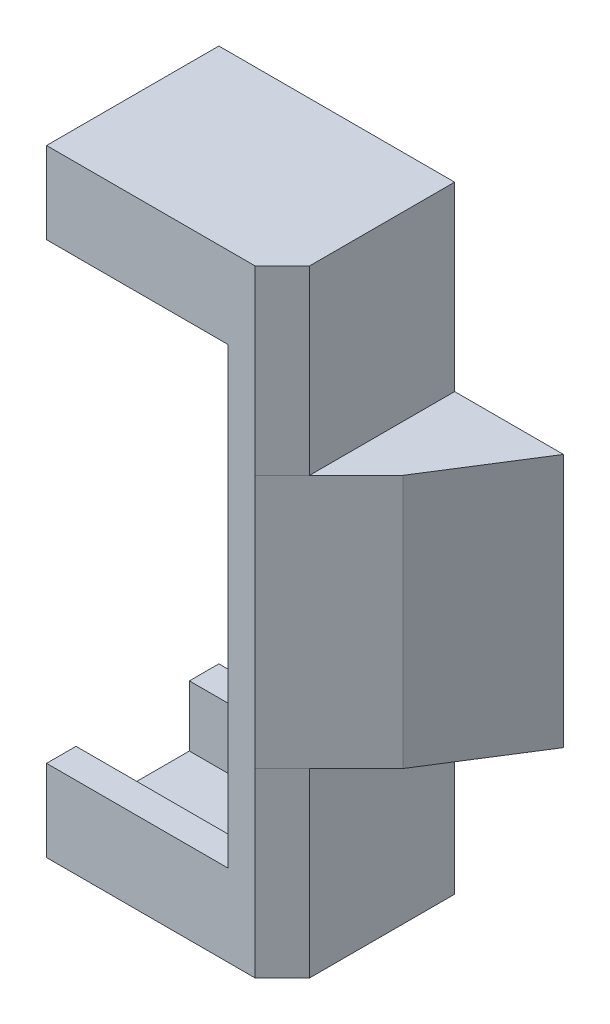
ISO-10303-21;
HEADER;
FILE_DESCRIPTION(('STEP AP214'),'2;1');
FILE_NAME('part.step','',(''),(''),'','','');
FILE_SCHEMA(('AUTOMOTIVE_DESIGN { 1 0 10303 214 1 1 1 1 }'));
ENDSEC;
DATA;
#1=APPLICATION_CONTEXT('core data for automotive mechanical design processes');
#2=APPLICATION_PROTOCOL_DEFINITION('international standard','automotive_design',2000,#1);
#3=PRODUCT_CONTEXT('',#1,'mechanical');
#4=PRODUCT('Part','Part','',(#3));
#5=PRODUCT_RELATED_PRODUCT_CATEGORY('part','',(#4));
#6=PRODUCT_DEFINITION_FORMATION('','',#4);
#7=PRODUCT_DEFINITION_CONTEXT('part definition',#1,'design');
#8=PRODUCT_DEFINITION('design','',#6,#7);
#9=PRODUCT_DEFINITION_SHAPE('','',#8);
#10=(LENGTH_UNIT() NAMED_UNIT(*) SI_UNIT(.MILLI.,.METRE.));
#11=(NAMED_UNIT(*) PLANE_ANGLE_UNIT() SI_UNIT($,.RADIAN.));
#12=(NAMED_UNIT(*) SI_UNIT($,.STERADIAN.) SOLID_ANGLE_UNIT());
#13=UNCERTAINTY_MEASURE_WITH_UNIT(LENGTH_MEASURE(1.E-05),#10,'distance_accuracy_value','');
#14=(GEOMETRIC_REPRESENTATION_CONTEXT(3) GLOBAL_UNCERTAINTY_ASSIGNED_CONTEXT((#13)) GLOBAL_UNIT_ASSIGNED_CONTEXT((#10,
#11,#12)) REPRESENTATION_CONTEXT('',''));
#15=CARTESIAN_POINT('',(0.,0.,0.));
#16=DIRECTION('',(0.,0.,1.));
#17=DIRECTION('',(1.,0.,0.));
#18=AXIS2_PLACEMENT_3D('',#15,#16,#17);
#19=CARTESIAN_POINT('',(-6.5,34.,-4.75));
#20=DIRECTION('',(1.,0.,0.));
#21=DIRECTION('',(0.,0.,-1.));
#22=AXIS2_PLACEMENT_3D('',#19,#20,#21);
#23=PLANE('',#22);
#24=DIRECTION('',(0.,-1.,0.));
#25=VECTOR('',#24,1.);
#26=CARTESIAN_POINT('',(-6.5,34.,4.75));
#27=LINE('',#26,#25);
#28=CARTESIAN_POINT('',(-6.5,4.5,4.75));
#29=VERTEX_POINT('',#28);
#30=CARTESIAN_POINT('',(-6.5,0.,4.75));
#31=VERTEX_POINT('',#30);
#32=EDGE_CURVE('E361',#29,#31,#27,.T.);
#33=ORIENTED_EDGE('',*,*,#32,.F.);
#34=DIRECTION('',(0.,0.,1.));
#35=VECTOR('',#34,1.);
#36=CARTESIAN_POINT('',(-6.5,4.5,-7.25));
#37=LINE('',#36,#35);
#38=CARTESIAN_POINT('',(-6.5,4.5,3.125));
#39=VERTEX_POINT('',#38);
#40=EDGE_CURVE('E403',#39,#29,#37,.T.);
#41=ORIENTED_EDGE('',*,*,#40,.F.);
#42=DIRECTION('',(0.,1.,0.));
#43=VECTOR('',#42,1.);
#44=CARTESIAN_POINT('',(-6.5,32.85,3.125));
#45=LINE('',#44,#43);
#46=CARTESIAN_POINT('',(-6.5,1.15,3.125));
#47=VERTEX_POINT('',#46);
#48=EDGE_CURVE('E335',#47,#39,#45,.T.);
#49=ORIENTED_EDGE('',*,*,#48,.F.);
#50=DIRECTION('',(0.,0.,1.));
#51=VECTOR('',#50,1.);
#52=CARTESIAN_POINT('',(-6.5,1.15,-3.125));
#53=LINE('',#52,#51);
#54=CARTESIAN_POINT('',(-6.5,1.15,-3.125));
#55=VERTEX_POINT('',#54);
#56=EDGE_CURVE('E325',#55,#47,#53,.T.);
#57=ORIENTED_EDGE('',*,*,#56,.F.);
#58=DIRECTION('',(0.,-1.,0.));
#59=VECTOR('',#58,1.);
#60=CARTESIAN_POINT('',(-6.5,32.85,-3.125));
#61=LINE('',#60,#59);
#62=CARTESIAN_POINT('',(-6.5,4.5,-3.125));
#63=VERTEX_POINT('',#62);
#64=EDGE_CURVE('E341',#63,#55,#61,.T.);
#65=ORIENTED_EDGE('',*,*,#64,.F.);
#66=CARTESIAN_POINT('',(-6.5,4.5,-4.75));
#67=VERTEX_POINT('',#66);
#68=EDGE_CURVE('E402',#67,#63,#37,.T.);
#69=ORIENTED_EDGE('',*,*,#68,.F.);
#70=DIRECTION('',(0.,-1.,0.));
#71=VECTOR('',#70,1.);
#72=CARTESIAN_POINT('',(-6.5,34.,-4.75));
#73=LINE('',#72,#71);
#74=CARTESIAN_POINT('',(-6.5,0.,-4.75));
#75=VERTEX_POINT('',#74);
#76=EDGE_CURVE('E216',#67,#75,#73,.T.);
#77=ORIENTED_EDGE('',*,*,#76,.T.);
#78=DIRECTION('',(0.,0.,1.));
#79=VECTOR('',#78,1.);
#80=CARTESIAN_POINT('',(-6.5,0.,-4.75));
#81=LINE('',#80,#79);
#82=EDGE_CURVE('E363',#75,#31,#81,.T.);
#83=ORIENTED_EDGE('',*,*,#82,.T.);
#84=EDGE_LOOP('',(#33,#41,#49,#57,#65,#69,#77,#83));
#85=FACE_BOUND('',#84,.T.);
#86=ADVANCED_FACE('F35',(#85),#23,.F.);
#87=CARTESIAN_POINT('',(12.5,34.,-4.75));
#88=DIRECTION('',(-0.845488903030971,0.,-0.533992991387982));
#89=DIRECTION('',(-0.533992991387982,0.,0.845488903030971));
#90=AXIS2_PLACEMENT_3D('',#87,#88,#89);
#91=PLANE('',#90);
#92=DIRECTION('',(-0.533992991387982,0.,0.845488903030971));
#93=VECTOR('',#92,1.);
#94=CARTESIAN_POINT('',(12.5,24.,-4.75));
#95=LINE('',#94,#93);
#96=CARTESIAN_POINT('',(12.5,24.,-4.75));
#97=VERTEX_POINT('',#96);
#98=CARTESIAN_POINT('',(9.07142857142856,24.,0.678571428571446));
#99=VERTEX_POINT('',#98);
#100=EDGE_CURVE('E391',#97,#99,#95,.T.);
#101=ORIENTED_EDGE('',*,*,#100,.T.);
#102=DIRECTION('',(0.,-1.,0.));
#103=VECTOR('',#102,1.);
#104=CARTESIAN_POINT('',(9.07142857142856,34.,0.678571428571445));
#105=LINE('',#104,#103);
#106=CARTESIAN_POINT('',(9.07142857142856,10.,0.678571428571446));
#107=VERTEX_POINT('',#106);
#108=EDGE_CURVE('E189',#99,#107,#105,.T.);
#109=ORIENTED_EDGE('',*,*,#108,.T.);
#110=DIRECTION('',(0.533992991387982,0.,-0.845488903030971));
#111=VECTOR('',#110,1.);
#112=CARTESIAN_POINT('',(12.5,10.,-4.75));
#113=LINE('',#112,#111);
#114=CARTESIAN_POINT('',(12.5,10.,-4.75));
#115=VERTEX_POINT('',#114);
#116=EDGE_CURVE('E184',#107,#115,#113,.T.);
#117=ORIENTED_EDGE('',*,*,#116,.T.);
#118=DIRECTION('',(0.,-1.,0.));
#119=VECTOR('',#118,1.);
#120=CARTESIAN_POINT('',(12.5,34.,-4.75));
#121=LINE('',#120,#119);
#122=EDGE_CURVE('E188',#97,#115,#121,.T.);
#123=ORIENTED_EDGE('',*,*,#122,.F.);
#124=EDGE_LOOP('',(#101,#109,#117,#123));
#125=FACE_BOUND('',#124,.T.);
#126=ADVANCED_FACE('F186',(#125),#91,.F.);
#127=CARTESIAN_POINT('',(-6.5,34.,-4.75));
#128=DIRECTION('',(0.,0.,1.));
#129=DIRECTION('',(1.,0.,0.));
#130=AXIS2_PLACEMENT_3D('',#127,#128,#129);
#131=PLANE('',#130);
#132=DIRECTION('',(-1.,0.,0.));
#133=VECTOR('',#132,1.);
#134=CARTESIAN_POINT('',(-6.5,10.,-4.75));
#135=LINE('',#134,#133);
#136=CARTESIAN_POINT('',(6.5,10.,-4.75));
#137=VERTEX_POINT('',#136);
#138=EDGE_CURVE('E196',#115,#137,#135,.T.);
#139=ORIENTED_EDGE('',*,*,#138,.T.);
#140=DIRECTION('',(0.,-1.,0.));
#141=VECTOR('',#140,1.);
#142=CARTESIAN_POINT('',(6.5,34.,-4.75));
#143=LINE('',#142,#141);
#144=CARTESIAN_POINT('',(6.5,0.,-4.75));
#145=VERTEX_POINT('',#144);
#146=EDGE_CURVE('E192',#137,#145,#143,.T.);
#147=ORIENTED_EDGE('',*,*,#146,.T.);
#148=DIRECTION('',(-1.,0.,0.));
#149=VECTOR('',#148,1.);
#150=CARTESIAN_POINT('',(-6.5,0.,-4.75));
#151=LINE('',#150,#149);
#152=EDGE_CURVE('E348',#145,#75,#151,.T.);
#153=ORIENTED_EDGE('',*,*,#152,.T.);
#154=ORIENTED_EDGE('',*,*,#76,.F.);
#155=DIRECTION('',(1.,0.,0.));
#156=VECTOR('',#155,1.);
#157=CARTESIAN_POINT('',(-6.5,4.5,-4.75));
#158=LINE('',#157,#156);
#159=CARTESIAN_POINT('',(3.5,4.5,-4.75));
#160=VERTEX_POINT('',#159);
#161=EDGE_CURVE('E308',#67,#160,#158,.T.);
#162=ORIENTED_EDGE('',*,*,#161,.T.);
#163=DIRECTION('',(0.,1.,0.));
#164=VECTOR('',#163,1.);
#165=CARTESIAN_POINT('',(3.5,34.,-4.75));
#166=LINE('',#165,#164);
#167=CARTESIAN_POINT('',(3.5,29.5,-4.75));
#168=VERTEX_POINT('',#167);
#169=EDGE_CURVE('E301',#160,#168,#166,.T.);
#170=ORIENTED_EDGE('',*,*,#169,.T.);
#171=DIRECTION('',(-1.,0.,0.));
#172=VECTOR('',#171,1.);
#173=CARTESIAN_POINT('',(-6.5,29.5,-4.75));
#174=LINE('',#173,#172);
#175=CARTESIAN_POINT('',(-6.5,29.5,-4.75));
#176=VERTEX_POINT('',#175);
#177=EDGE_CURVE('E299',#168,#176,#174,.T.);
#178=ORIENTED_EDGE('',*,*,#177,.T.);
#179=CARTESIAN_POINT('',(-6.5,34.,-4.75));
#180=VERTEX_POINT('',#179);
#181=EDGE_CURVE('E210',#180,#176,#73,.T.);
#182=ORIENTED_EDGE('',*,*,#181,.F.);
#183=DIRECTION('',(-1.,0.,0.));
#184=VECTOR('',#183,1.);
#185=CARTESIAN_POINT('',(6.5,34.,-4.75));
#186=LINE('',#185,#184);
#187=CARTESIAN_POINT('',(6.5,34.,-4.75));
#188=VERTEX_POINT('',#187);
#189=EDGE_CURVE('E297',#188,#180,#186,.T.);
#190=ORIENTED_EDGE('',*,*,#189,.F.);
#191=DIRECTION('',(0.,-1.,0.));
#192=VECTOR('',#191,1.);
#193=CARTESIAN_POINT('',(6.5,34.,-4.75));
#194=LINE('',#193,#192);
#195=CARTESIAN_POINT('',(6.5,24.,-4.75));
#196=VERTEX_POINT('',#195);
#197=EDGE_CURVE('E389',#188,#196,#194,.T.);
#198=ORIENTED_EDGE('',*,*,#197,.T.);
#199=DIRECTION('',(1.,0.,0.));
#200=VECTOR('',#199,1.);
#201=CARTESIAN_POINT('',(-6.5,24.,-4.75));
#202=LINE('',#201,#200);
#203=EDGE_CURVE('E208',#196,#97,#202,.T.);
#204=ORIENTED_EDGE('',*,*,#203,.T.);
#205=ORIENTED_EDGE('',*,*,#122,.T.);
#206=EDGE_LOOP('',(#139,#147,#153,#154,#162,#170,#178,#182,#190,#198,#204,#205));
#207=FACE_BOUND('',#206,.T.);
#208=ADVANCED_FACE('F206',(#207),#131,.F.);
#209=ORIENTED_EDGE('',*,*,#181,.T.);
#210=DIRECTION('',(0.,0.,1.));
#211=VECTOR('',#210,1.);
#212=CARTESIAN_POINT('',(-6.5,29.5,-7.25));
#213=LINE('',#212,#211);
#214=CARTESIAN_POINT('',(-6.5,29.5,-3.125));
#215=VERTEX_POINT('',#214);
#216=EDGE_CURVE('E291',#176,#215,#213,.T.);
#217=ORIENTED_EDGE('',*,*,#216,.T.);
#218=CARTESIAN_POINT('',(-6.5,32.85,-3.125));
#219=VERTEX_POINT('',#218);
#220=EDGE_CURVE('E342',#219,#215,#61,.T.);
#221=ORIENTED_EDGE('',*,*,#220,.F.);
#222=DIRECTION('',(0.,0.,-1.));
#223=VECTOR('',#222,1.);
#224=CARTESIAN_POINT('',(-6.5,32.85,-3.125));
#225=LINE('',#224,#223);
#226=CARTESIAN_POINT('',(-6.5,32.85,3.125));
#227=VERTEX_POINT('',#226);
#228=EDGE_CURVE('E338',#227,#219,#225,.T.);
#229=ORIENTED_EDGE('',*,*,#228,.F.);
#230=CARTESIAN_POINT('',(-6.5,29.5,3.125));
#231=VERTEX_POINT('',#230);
#232=EDGE_CURVE('E320',#231,#227,#45,.T.);
#233=ORIENTED_EDGE('',*,*,#232,.F.);
#234=CARTESIAN_POINT('',(-6.5,29.5,4.75));
#235=VERTEX_POINT('',#234);
#236=EDGE_CURVE('E405',#231,#235,#213,.T.);
#237=ORIENTED_EDGE('',*,*,#236,.T.);
#238=CARTESIAN_POINT('',(-6.5,34.,4.75));
#239=VERTEX_POINT('',#238);
#240=EDGE_CURVE('E366',#239,#235,#27,.T.);
#241=ORIENTED_EDGE('',*,*,#240,.F.);
#242=DIRECTION('',(0.,0.,1.));
#243=VECTOR('',#242,1.);
#244=CARTESIAN_POINT('',(-6.5,34.,-4.75));
#245=LINE('',#244,#243);
#246=EDGE_CURVE('E294',#180,#239,#245,.T.);
#247=ORIENTED_EDGE('',*,*,#246,.F.);
#248=EDGE_LOOP('',(#209,#217,#221,#229,#233,#237,#241,#247));
#249=FACE_BOUND('',#248,.T.);
#250=ADVANCED_FACE('F272',(#249),#23,.F.);
#251=CARTESIAN_POINT('',(-6.5,34.,4.75));
#252=DIRECTION('',(0.,0.,-1.));
#253=DIRECTION('',(-1.,0.,0.));
#254=AXIS2_PLACEMENT_3D('',#251,#252,#253);
#255=PLANE('',#254);
#256=DIRECTION('',(0.,1.,0.));
#257=VECTOR('',#256,1.);
#258=CARTESIAN_POINT('',(5.,34.,4.75));
#259=LINE('',#258,#257);
#260=CARTESIAN_POINT('',(5.,0.,4.75));
#261=VERTEX_POINT('',#260);
#262=CARTESIAN_POINT('',(5.,10.,4.75));
#263=VERTEX_POINT('',#262);
#264=EDGE_CURVE('E245',#261,#263,#259,.T.);
#265=ORIENTED_EDGE('',*,*,#264,.T.);
#266=DIRECTION('',(0.,1.,0.));
#267=VECTOR('',#266,1.);
#268=CARTESIAN_POINT('',(4.99999999999999,34.,4.75));
#269=LINE('',#268,#267);
#270=CARTESIAN_POINT('',(5.,24.,4.75));
#271=VERTEX_POINT('',#270);
#272=EDGE_CURVE('E43',#263,#271,#269,.T.);
#273=ORIENTED_EDGE('',*,*,#272,.T.);
#274=DIRECTION('',(0.,1.,0.));
#275=VECTOR('',#274,1.);
#276=CARTESIAN_POINT('',(5.,34.,4.75));
#277=LINE('',#276,#275);
#278=CARTESIAN_POINT('',(5.,34.,4.75));
#279=VERTEX_POINT('',#278);
#280=EDGE_CURVE('E233',#271,#279,#277,.T.);
#281=ORIENTED_EDGE('',*,*,#280,.T.);
#282=DIRECTION('',(1.,0.,0.));
#283=VECTOR('',#282,1.);
#284=CARTESIAN_POINT('',(-6.5,34.,4.75));
#285=LINE('',#284,#283);
#286=EDGE_CURVE('E359',#239,#279,#285,.T.);
#287=ORIENTED_EDGE('',*,*,#286,.F.);
#288=ORIENTED_EDGE('',*,*,#240,.T.);
#289=DIRECTION('',(-1.,0.,0.));
#290=VECTOR('',#289,1.);
#291=CARTESIAN_POINT('',(3.5,29.5,4.75));
#292=LINE('',#291,#290);
#293=CARTESIAN_POINT('',(3.5,29.5,4.75));
#294=VERTEX_POINT('',#293);
#295=EDGE_CURVE('E396',#294,#235,#292,.T.);
#296=ORIENTED_EDGE('',*,*,#295,.F.);
#297=DIRECTION('',(0.,1.,0.));
#298=VECTOR('',#297,1.);
#299=CARTESIAN_POINT('',(3.5,4.5,4.75));
#300=LINE('',#299,#298);
#301=CARTESIAN_POINT('',(3.5,4.5,4.75));
#302=VERTEX_POINT('',#301);
#303=EDGE_CURVE('E393',#302,#294,#300,.T.);
#304=ORIENTED_EDGE('',*,*,#303,.F.);
#305=DIRECTION('',(1.,0.,0.));
#306=VECTOR('',#305,1.);
#307=CARTESIAN_POINT('',(-6.5,4.5,4.75));
#308=LINE('',#307,#306);
#309=EDGE_CURVE('E374',#29,#302,#308,.T.);
#310=ORIENTED_EDGE('',*,*,#309,.F.);
#311=ORIENTED_EDGE('',*,*,#32,.T.);
#312=DIRECTION('',(1.,0.,0.));
#313=VECTOR('',#312,1.);
#314=CARTESIAN_POINT('',(-6.5,0.,4.75));
#315=LINE('',#314,#313);
#316=EDGE_CURVE('E357',#31,#261,#315,.T.);
#317=ORIENTED_EDGE('',*,*,#316,.T.);
#318=EDGE_LOOP('',(#265,#273,#281,#287,#288,#296,#304,#310,#311,#317));
#319=FACE_BOUND('',#318,.T.);
#320=ADVANCED_FACE('F253',(#319),#255,.F.);
#321=CARTESIAN_POINT('',(0.,34.,0.));
#322=DIRECTION('',(0.,1.,0.));
#323=DIRECTION('',(0.,0.,1.));
#324=AXIS2_PLACEMENT_3D('',#321,#322,#323);
#325=PLANE('',#324);
#326=ORIENTED_EDGE('',*,*,#286,.T.);
#327=DIRECTION('',(-0.707106781186548,0.,0.707106781186547));
#328=VECTOR('',#327,1.);
#329=CARTESIAN_POINT('',(4.87499999999999,34.,4.875));
#330=LINE('',#329,#328);
#331=CARTESIAN_POINT('',(6.5,34.,3.25));
#332=VERTEX_POINT('',#331);
#333=EDGE_CURVE('E235',#279,#332,#330,.F.);
#334=ORIENTED_EDGE('',*,*,#333,.T.);
#335=DIRECTION('',(0.,0.,1.));
#336=VECTOR('',#335,1.);
#337=CARTESIAN_POINT('',(6.5,34.,0.));
#338=LINE('',#337,#336);
#339=EDGE_CURVE('E225',#188,#332,#338,.T.);
#340=ORIENTED_EDGE('',*,*,#339,.F.);
#341=ORIENTED_EDGE('',*,*,#189,.T.);
#342=ORIENTED_EDGE('',*,*,#246,.T.);
#343=EDGE_LOOP('',(#326,#334,#340,#341,#342));
#344=FACE_BOUND('',#343,.T.);
#345=ADVANCED_FACE('F286',(#344),#325,.T.);
#346=CARTESIAN_POINT('',(0.,0.,0.));
#347=DIRECTION('',(0.,1.,0.));
#348=DIRECTION('',(0.,0.,1.));
#349=AXIS2_PLACEMENT_3D('',#346,#347,#348);
#350=PLANE('',#349);
#351=DIRECTION('',(0.,0.,1.));
#352=VECTOR('',#351,1.);
#353=CARTESIAN_POINT('',(6.5,0.,0.));
#354=LINE('',#353,#352);
#355=CARTESIAN_POINT('',(6.5,0.,3.25));
#356=VERTEX_POINT('',#355);
#357=EDGE_CURVE('E203',#145,#356,#354,.T.);
#358=ORIENTED_EDGE('',*,*,#357,.T.);
#359=DIRECTION('',(0.707106781186548,0.,-0.707106781186547));
#360=VECTOR('',#359,1.);
#361=CARTESIAN_POINT('',(6.5,0.,3.25));
#362=LINE('',#361,#360);
#363=EDGE_CURVE('E243',#356,#261,#362,.F.);
#364=ORIENTED_EDGE('',*,*,#363,.T.);
#365=ORIENTED_EDGE('',*,*,#316,.F.);
#366=ORIENTED_EDGE('',*,*,#82,.F.);
#367=ORIENTED_EDGE('',*,*,#152,.F.);
#368=EDGE_LOOP('',(#358,#364,#365,#366,#367));
#369=FACE_BOUND('',#368,.T.);
#370=ADVANCED_FACE('F381',(#369),#350,.F.);
#371=CARTESIAN_POINT('',(5.5,32.85,3.125));
#372=DIRECTION('',(0.,0.,1.));
#373=DIRECTION('',(0.,-1.,0.));
#374=AXIS2_PLACEMENT_3D('',#371,#372,#373);
#375=PLANE('',#374);
#376=ORIENTED_EDGE('',*,*,#48,.T.);
#377=DIRECTION('',(1.,0.,0.));
#378=VECTOR('',#377,1.);
#379=CARTESIAN_POINT('',(5.5,4.5,3.125));
#380=LINE('',#379,#378);
#381=CARTESIAN_POINT('',(3.5,4.5,3.125));
#382=VERTEX_POINT('',#381);
#383=EDGE_CURVE('E304',#39,#382,#380,.T.);
#384=ORIENTED_EDGE('',*,*,#383,.T.);
#385=DIRECTION('',(0.,1.,0.));
#386=VECTOR('',#385,1.);
#387=CARTESIAN_POINT('',(3.5,32.85,3.125));
#388=LINE('',#387,#386);
#389=CARTESIAN_POINT('',(3.5,29.5,3.125));
#390=VERTEX_POINT('',#389);
#391=EDGE_CURVE('E316',#382,#390,#388,.T.);
#392=ORIENTED_EDGE('',*,*,#391,.T.);
#393=DIRECTION('',(-1.,0.,0.));
#394=VECTOR('',#393,1.);
#395=CARTESIAN_POINT('',(5.5,29.5,3.125));
#396=LINE('',#395,#394);
#397=EDGE_CURVE('E305',#390,#231,#396,.T.);
#398=ORIENTED_EDGE('',*,*,#397,.T.);
#399=ORIENTED_EDGE('',*,*,#232,.T.);
#400=DIRECTION('',(-1.,0.,0.));
#401=VECTOR('',#400,1.);
#402=CARTESIAN_POINT('',(5.5,32.85,3.125));
#403=LINE('',#402,#401);
#404=CARTESIAN_POINT('',(5.5,32.85,3.125));
#405=VERTEX_POINT('',#404);
#406=EDGE_CURVE('E334',#405,#227,#403,.T.);
#407=ORIENTED_EDGE('',*,*,#406,.F.);
#408=DIRECTION('',(0.,1.,0.));
#409=VECTOR('',#408,1.);
#410=CARTESIAN_POINT('',(5.5,32.85,3.125));
#411=LINE('',#410,#409);
#412=CARTESIAN_POINT('',(5.5,1.15,3.125));
#413=VERTEX_POINT('',#412);
#414=EDGE_CURVE('E321',#413,#405,#411,.T.);
#415=ORIENTED_EDGE('',*,*,#414,.F.);
#416=DIRECTION('',(-1.,0.,0.));
#417=VECTOR('',#416,1.);
#418=CARTESIAN_POINT('',(5.5,1.15,3.125));
#419=LINE('',#418,#417);
#420=EDGE_CURVE('E346',#413,#47,#419,.T.);
#421=ORIENTED_EDGE('',*,*,#420,.T.);
#422=EDGE_LOOP('',(#376,#384,#392,#398,#399,#407,#415,#421));
#423=FACE_BOUND('',#422,.T.);
#424=ADVANCED_FACE('F426',(#423),#375,.F.);
#425=CARTESIAN_POINT('',(5.5,1.15,-3.125));
#426=DIRECTION('',(0.,-1.,0.));
#427=DIRECTION('',(0.,0.,-1.));
#428=AXIS2_PLACEMENT_3D('',#425,#426,#427);
#429=PLANE('',#428);
#430=ORIENTED_EDGE('',*,*,#56,.T.);
#431=ORIENTED_EDGE('',*,*,#420,.F.);
#432=DIRECTION('',(0.,0.,1.));
#433=VECTOR('',#432,1.);
#434=CARTESIAN_POINT('',(5.5,1.15,-3.125));
#435=LINE('',#434,#433);
#436=CARTESIAN_POINT('',(5.5,1.15,-3.125));
#437=VERTEX_POINT('',#436);
#438=EDGE_CURVE('E331',#437,#413,#435,.T.);
#439=ORIENTED_EDGE('',*,*,#438,.F.);
#440=DIRECTION('',(-1.,0.,0.));
#441=VECTOR('',#440,1.);
#442=CARTESIAN_POINT('',(5.5,1.15,-3.125));
#443=LINE('',#442,#441);
#444=EDGE_CURVE('E349',#437,#55,#443,.T.);
#445=ORIENTED_EDGE('',*,*,#444,.T.);
#446=EDGE_LOOP('',(#430,#431,#439,#445));
#447=FACE_BOUND('',#446,.T.);
#448=ADVANCED_FACE('F460',(#447),#429,.F.);
#449=CARTESIAN_POINT('',(5.5,32.85,-3.125));
#450=DIRECTION('',(0.,0.,-1.));
#451=DIRECTION('',(0.,1.,0.));
#452=AXIS2_PLACEMENT_3D('',#449,#450,#451);
#453=PLANE('',#452);
#454=DIRECTION('',(0.,-1.,0.));
#455=VECTOR('',#454,1.);
#456=CARTESIAN_POINT('',(3.5,32.85,-3.125));
#457=LINE('',#456,#455);
#458=CARTESIAN_POINT('',(3.5,29.5,-3.125));
#459=VERTEX_POINT('',#458);
#460=CARTESIAN_POINT('',(3.5,4.5,-3.125));
#461=VERTEX_POINT('',#460);
#462=EDGE_CURVE('E213',#459,#461,#457,.T.);
#463=ORIENTED_EDGE('',*,*,#462,.T.);
#464=DIRECTION('',(-1.,0.,0.));
#465=VECTOR('',#464,1.);
#466=CARTESIAN_POINT('',(5.5,4.5,-3.125));
#467=LINE('',#466,#465);
#468=EDGE_CURVE('E222',#461,#63,#467,.T.);
#469=ORIENTED_EDGE('',*,*,#468,.T.);
#470=ORIENTED_EDGE('',*,*,#64,.T.);
#471=ORIENTED_EDGE('',*,*,#444,.F.);
#472=DIRECTION('',(0.,-1.,0.));
#473=VECTOR('',#472,1.);
#474=CARTESIAN_POINT('',(5.5,32.85,-3.125));
#475=LINE('',#474,#473);
#476=CARTESIAN_POINT('',(5.5,32.85,-3.125));
#477=VERTEX_POINT('',#476);
#478=EDGE_CURVE('E328',#477,#437,#475,.T.);
#479=ORIENTED_EDGE('',*,*,#478,.F.);
#480=DIRECTION('',(-1.,0.,0.));
#481=VECTOR('',#480,1.);
#482=CARTESIAN_POINT('',(5.5,32.85,-3.125));
#483=LINE('',#482,#481);
#484=EDGE_CURVE('E352',#477,#219,#483,.T.);
#485=ORIENTED_EDGE('',*,*,#484,.T.);
#486=ORIENTED_EDGE('',*,*,#220,.T.);
#487=DIRECTION('',(1.,0.,0.));
#488=VECTOR('',#487,1.);
#489=CARTESIAN_POINT('',(5.5,29.5,-3.125));
#490=LINE('',#489,#488);
#491=EDGE_CURVE('E209',#215,#459,#490,.T.);
#492=ORIENTED_EDGE('',*,*,#491,.T.);
#493=EDGE_LOOP('',(#463,#469,#470,#471,#479,#485,#486,#492));
#494=FACE_BOUND('',#493,.T.);
#495=ADVANCED_FACE('F417',(#494),#453,.F.);
#496=CARTESIAN_POINT('',(5.5,32.85,-3.125));
#497=DIRECTION('',(0.,1.,0.));
#498=DIRECTION('',(0.,0.,1.));
#499=AXIS2_PLACEMENT_3D('',#496,#497,#498);
#500=PLANE('',#499);
#501=ORIENTED_EDGE('',*,*,#228,.T.);
#502=ORIENTED_EDGE('',*,*,#484,.F.);
#503=DIRECTION('',(0.,0.,-1.));
#504=VECTOR('',#503,1.);
#505=CARTESIAN_POINT('',(5.5,32.85,-3.125));
#506=LINE('',#505,#504);
#507=EDGE_CURVE('E324',#405,#477,#506,.T.);
#508=ORIENTED_EDGE('',*,*,#507,.F.);
#509=ORIENTED_EDGE('',*,*,#406,.T.);
#510=EDGE_LOOP('',(#501,#502,#508,#509));
#511=FACE_BOUND('',#510,.T.);
#512=ADVANCED_FACE('F422',(#511),#500,.F.);
#513=CARTESIAN_POINT('',(5.5,0.,0.));
#514=DIRECTION('',(-1.,0.,0.));
#515=DIRECTION('',(0.,0.,1.));
#516=AXIS2_PLACEMENT_3D('',#513,#514,#515);
#517=PLANE('',#516);
#518=ORIENTED_EDGE('',*,*,#414,.T.);
#519=ORIENTED_EDGE('',*,*,#507,.T.);
#520=ORIENTED_EDGE('',*,*,#478,.T.);
#521=ORIENTED_EDGE('',*,*,#438,.T.);
#522=EDGE_LOOP('',(#518,#519,#520,#521));
#523=FACE_BOUND('',#522,.T.);
#524=ADVANCED_FACE('F454',(#523),#517,.T.);
#525=CARTESIAN_POINT('',(3.5,29.5,-7.25));
#526=DIRECTION('',(0.,1.,0.));
#527=DIRECTION('',(0.,0.,1.));
#528=AXIS2_PLACEMENT_3D('',#525,#526,#527);
#529=PLANE('',#528);
#530=DIRECTION('',(0.,0.,1.));
#531=VECTOR('',#530,1.);
#532=CARTESIAN_POINT('',(3.5,29.5,-7.25));
#533=LINE('',#532,#531);
#534=EDGE_CURVE('E407',#168,#459,#533,.T.);
#535=ORIENTED_EDGE('',*,*,#534,.T.);
#536=ORIENTED_EDGE('',*,*,#491,.F.);
#537=ORIENTED_EDGE('',*,*,#216,.F.);
#538=ORIENTED_EDGE('',*,*,#177,.F.);
#539=EDGE_LOOP('',(#535,#536,#537,#538));
#540=FACE_BOUND('',#539,.T.);
#541=ADVANCED_FACE('F411',(#540),#529,.F.);
#542=CARTESIAN_POINT('',(-6.5,4.5,-7.25));
#543=DIRECTION('',(0.,-1.,0.));
#544=DIRECTION('',(0.,0.,-1.));
#545=AXIS2_PLACEMENT_3D('',#542,#543,#544);
#546=PLANE('',#545);
#547=ORIENTED_EDGE('',*,*,#68,.T.);
#548=ORIENTED_EDGE('',*,*,#468,.F.);
#549=DIRECTION('',(0.,0.,1.));
#550=VECTOR('',#549,1.);
#551=CARTESIAN_POINT('',(3.5,4.5,-7.25));
#552=LINE('',#551,#550);
#553=EDGE_CURVE('E311',#160,#461,#552,.T.);
#554=ORIENTED_EDGE('',*,*,#553,.F.);
#555=ORIENTED_EDGE('',*,*,#161,.F.);
#556=EDGE_LOOP('',(#547,#548,#554,#555));
#557=FACE_BOUND('',#556,.T.);
#558=ADVANCED_FACE('F449',(#557),#546,.F.);
#559=CARTESIAN_POINT('',(3.5,4.5,-7.25));
#560=DIRECTION('',(1.,0.,0.));
#561=DIRECTION('',(0.,1.,0.));
#562=AXIS2_PLACEMENT_3D('',#559,#560,#561);
#563=PLANE('',#562);
#564=ORIENTED_EDGE('',*,*,#553,.T.);
#565=ORIENTED_EDGE('',*,*,#462,.F.);
#566=ORIENTED_EDGE('',*,*,#534,.F.);
#567=ORIENTED_EDGE('',*,*,#169,.F.);
#568=EDGE_LOOP('',(#564,#565,#566,#567));
#569=FACE_BOUND('',#568,.T.);
#570=ADVANCED_FACE('F414',(#569),#563,.F.);
#571=EDGE_CURVE('E400',#382,#302,#552,.T.);
#572=ORIENTED_EDGE('',*,*,#571,.T.);
#573=ORIENTED_EDGE('',*,*,#303,.T.);
#574=EDGE_CURVE('E399',#390,#294,#533,.T.);
#575=ORIENTED_EDGE('',*,*,#574,.F.);
#576=ORIENTED_EDGE('',*,*,#391,.F.);
#577=EDGE_LOOP('',(#572,#573,#575,#576));
#578=FACE_BOUND('',#577,.T.);
#579=ADVANCED_FACE('F429',(#578),#563,.F.);
#580=ORIENTED_EDGE('',*,*,#40,.T.);
#581=ORIENTED_EDGE('',*,*,#309,.T.);
#582=ORIENTED_EDGE('',*,*,#571,.F.);
#583=ORIENTED_EDGE('',*,*,#383,.F.);
#584=EDGE_LOOP('',(#580,#581,#582,#583));
#585=FACE_BOUND('',#584,.T.);
#586=ADVANCED_FACE('F444',(#585),#546,.F.);
#587=ORIENTED_EDGE('',*,*,#574,.T.);
#588=ORIENTED_EDGE('',*,*,#295,.T.);
#589=ORIENTED_EDGE('',*,*,#236,.F.);
#590=ORIENTED_EDGE('',*,*,#397,.F.);
#591=EDGE_LOOP('',(#587,#588,#589,#590));
#592=FACE_BOUND('',#591,.T.);
#593=ADVANCED_FACE('F427',(#592),#529,.F.);
#594=CARTESIAN_POINT('',(6.5,24.,-5.25));
#595=DIRECTION('',(0.,-1.,0.));
#596=DIRECTION('',(0.,0.,-1.));
#597=AXIS2_PLACEMENT_3D('',#594,#595,#596);
#598=PLANE('',#597);
#599=DIRECTION('',(0.,0.,1.));
#600=VECTOR('',#599,1.);
#601=CARTESIAN_POINT('',(6.5,24.,-5.25));
#602=LINE('',#601,#600);
#603=CARTESIAN_POINT('',(6.5,24.,3.25));
#604=VERTEX_POINT('',#603);
#605=EDGE_CURVE('E191',#196,#604,#602,.T.);
#606=ORIENTED_EDGE('',*,*,#605,.T.);
#607=DIRECTION('',(-0.707106781186548,0.,0.707106781186547));
#608=VECTOR('',#607,1.);
#609=CARTESIAN_POINT('',(9.07142857142856,24.,0.678571428571444));
#610=LINE('',#609,#608);
#611=EDGE_CURVE('E11',#604,#99,#610,.F.);
#612=ORIENTED_EDGE('',*,*,#611,.T.);
#613=ORIENTED_EDGE('',*,*,#100,.F.);
#614=ORIENTED_EDGE('',*,*,#203,.F.);
#615=EDGE_LOOP('',(#606,#612,#613,#614));
#616=FACE_BOUND('',#615,.T.);
#617=ADVANCED_FACE('F436',(#616),#598,.F.);
#618=CARTESIAN_POINT('',(6.5,34.,-5.25));
#619=DIRECTION('',(-1.,0.,0.));
#620=DIRECTION('',(0.,-1.,0.));
#621=AXIS2_PLACEMENT_3D('',#618,#619,#620);
#622=PLANE('',#621);
#623=ORIENTED_EDGE('',*,*,#339,.T.);
#624=DIRECTION('',(0.,-1.,0.));
#625=VECTOR('',#624,1.);
#626=CARTESIAN_POINT('',(6.5,34.,3.25));
#627=LINE('',#626,#625);
#628=EDGE_CURVE('E202',#332,#604,#627,.T.);
#629=ORIENTED_EDGE('',*,*,#628,.T.);
#630=ORIENTED_EDGE('',*,*,#605,.F.);
#631=ORIENTED_EDGE('',*,*,#197,.F.);
#632=EDGE_LOOP('',(#623,#629,#630,#631));
#633=FACE_BOUND('',#632,.T.);
#634=ADVANCED_FACE('F434',(#633),#622,.F.);
#635=CARTESIAN_POINT('',(6.5,10.,-5.25));
#636=DIRECTION('',(0.,1.,0.));
#637=DIRECTION('',(0.,0.,1.));
#638=AXIS2_PLACEMENT_3D('',#635,#636,#637);
#639=PLANE('',#638);
#640=ORIENTED_EDGE('',*,*,#116,.F.);
#641=DIRECTION('',(0.707106781186548,0.,-0.707106781186547));
#642=VECTOR('',#641,1.);
#643=CARTESIAN_POINT('',(9.07142857142856,10.,0.678571428571444));
#644=LINE('',#643,#642);
#645=CARTESIAN_POINT('',(6.5,10.,3.25));
#646=VERTEX_POINT('',#645);
#647=EDGE_CURVE('E56',#107,#646,#644,.F.);
#648=ORIENTED_EDGE('',*,*,#647,.T.);
#649=DIRECTION('',(0.,0.,1.));
#650=VECTOR('',#649,1.);
#651=CARTESIAN_POINT('',(6.5,10.,-5.25));
#652=LINE('',#651,#650);
#653=EDGE_CURVE('E199',#137,#646,#652,.T.);
#654=ORIENTED_EDGE('',*,*,#653,.F.);
#655=ORIENTED_EDGE('',*,*,#138,.F.);
#656=EDGE_LOOP('',(#640,#648,#654,#655));
#657=FACE_BOUND('',#656,.T.);
#658=ADVANCED_FACE('F197',(#657),#639,.F.);
#659=CARTESIAN_POINT('',(6.5,0.,-5.25));
#660=DIRECTION('',(-1.,0.,0.));
#661=DIRECTION('',(0.,0.,1.));
#662=AXIS2_PLACEMENT_3D('',#659,#660,#661);
#663=PLANE('',#662);
#664=ORIENTED_EDGE('',*,*,#653,.T.);
#665=DIRECTION('',(0.,-1.,0.));
#666=VECTOR('',#665,1.);
#667=CARTESIAN_POINT('',(6.5,0.,3.25));
#668=LINE('',#667,#666);
#669=EDGE_CURVE('E240',#646,#356,#668,.T.);
#670=ORIENTED_EDGE('',*,*,#669,.T.);
#671=ORIENTED_EDGE('',*,*,#357,.F.);
#672=ORIENTED_EDGE('',*,*,#146,.F.);
#673=EDGE_LOOP('',(#664,#670,#671,#672));
#674=FACE_BOUND('',#673,.T.);
#675=ADVANCED_FACE('F384',(#674),#663,.F.);
#676=CARTESIAN_POINT('',(6.5,34.,3.25));
#677=DIRECTION('',(-0.707106781186547,0.,-0.707106781186548));
#678=DIRECTION('',(0.,-1.,0.));
#679=AXIS2_PLACEMENT_3D('',#676,#677,#678);
#680=PLANE('',#679);
#681=ORIENTED_EDGE('',*,*,#333,.F.);
#682=ORIENTED_EDGE('',*,*,#280,.F.);
#683=DIRECTION('',(0.707106781186548,0.,-0.707106781186547));
#684=VECTOR('',#683,1.);
#685=CARTESIAN_POINT('',(10.75,24.,-0.999999999999989));
#686=LINE('',#685,#684);
#687=EDGE_CURVE('E237',#604,#271,#686,.F.);
#688=ORIENTED_EDGE('',*,*,#687,.F.);
#689=ORIENTED_EDGE('',*,*,#628,.F.);
#690=EDGE_LOOP('',(#681,#682,#688,#689));
#691=FACE_BOUND('',#690,.T.);
#692=ADVANCED_FACE('F261',(#691),#680,.F.);
#693=CARTESIAN_POINT('',(6.5,0.,3.25));
#694=DIRECTION('',(-0.707106781186547,0.,-0.707106781186548));
#695=DIRECTION('',(0.,-1.,0.));
#696=AXIS2_PLACEMENT_3D('',#693,#694,#695);
#697=PLANE('',#696);
#698=DIRECTION('',(-0.707106781186548,0.,0.707106781186547));
#699=VECTOR('',#698,1.);
#700=CARTESIAN_POINT('',(10.75,10.,-0.999999999999989));
#701=LINE('',#700,#699);
#702=EDGE_CURVE('E247',#263,#646,#701,.F.);
#703=ORIENTED_EDGE('',*,*,#702,.F.);
#704=ORIENTED_EDGE('',*,*,#264,.F.);
#705=ORIENTED_EDGE('',*,*,#363,.F.);
#706=ORIENTED_EDGE('',*,*,#669,.F.);
#707=EDGE_LOOP('',(#703,#704,#705,#706));
#708=FACE_BOUND('',#707,.T.);
#709=ADVANCED_FACE('F264',(#708),#697,.F.);
#710=CARTESIAN_POINT('',(9.07142857142856,34.,0.678571428571444));
#711=DIRECTION('',(-0.707106781186547,0.,-0.707106781186548));
#712=DIRECTION('',(0.,-1.,0.));
#713=AXIS2_PLACEMENT_3D('',#710,#711,#712);
#714=PLANE('',#713);
#715=ORIENTED_EDGE('',*,*,#687,.T.);
#716=ORIENTED_EDGE('',*,*,#272,.F.);
#717=ORIENTED_EDGE('',*,*,#702,.T.);
#718=ORIENTED_EDGE('',*,*,#647,.F.);
#719=ORIENTED_EDGE('',*,*,#108,.F.);
#720=ORIENTED_EDGE('',*,*,#611,.F.);
#721=EDGE_LOOP('',(#715,#716,#717,#718,#719,#720));
#722=FACE_BOUND('',#721,.T.);
#723=ADVANCED_FACE('F37',(#722),#714,.F.);
#724=CLOSED_SHELL('',(#86,#126,#208,#250,#320,#345,#370,#424,#448,#495,#512,#524,#541,#558,#570,
#579,#586,#593,#617,#634,#658,#675,#692,#709,#723));
#725=MANIFOLD_SOLID_BREP('B2',#724);
#726=ADVANCED_BREP_SHAPE_REPRESENTATION('',(#18,#725),#14);
#727=SHAPE_DEFINITION_REPRESENTATION(#9,#726);
ENDSEC;
END-ISO-10303-21;
